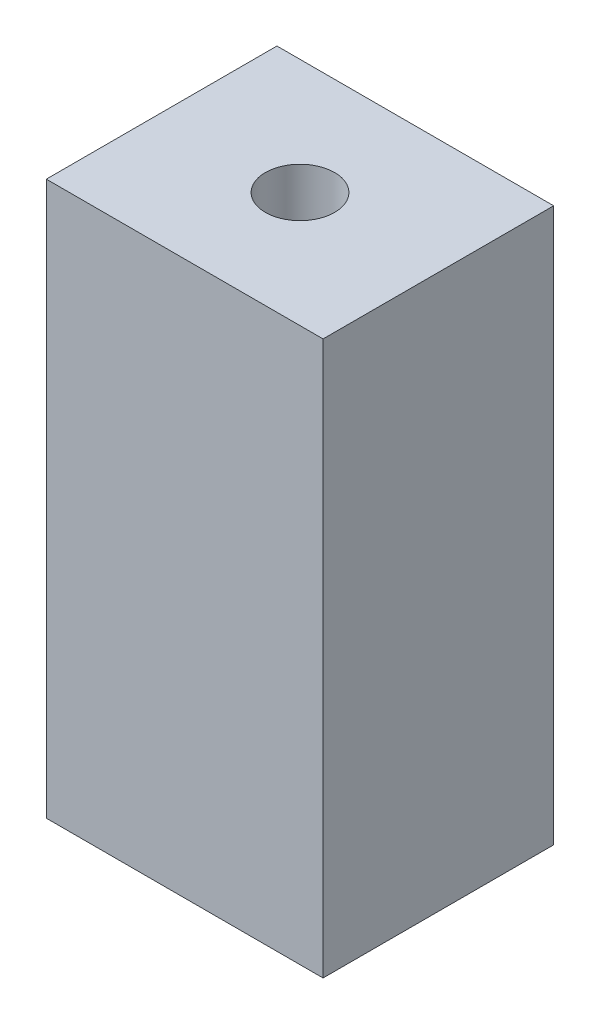
ISO-10303-21;
HEADER;
FILE_DESCRIPTION(('STEP AP214'),'2;1');
FILE_NAME('part.step','',(''),(''),'','','');
FILE_SCHEMA(('AUTOMOTIVE_DESIGN { 1 0 10303 214 1 1 1 1 }'));
ENDSEC;
DATA;
#1=APPLICATION_CONTEXT('core data for automotive mechanical design processes');
#2=APPLICATION_PROTOCOL_DEFINITION('international standard','automotive_design',2000,#1);
#3=PRODUCT_CONTEXT('',#1,'mechanical');
#4=PRODUCT('Part','Part','',(#3));
#5=PRODUCT_RELATED_PRODUCT_CATEGORY('part','',(#4));
#6=PRODUCT_DEFINITION_FORMATION('','',#4);
#7=PRODUCT_DEFINITION_CONTEXT('part definition',#1,'design');
#8=PRODUCT_DEFINITION('design','',#6,#7);
#9=PRODUCT_DEFINITION_SHAPE('','',#8);
#10=(LENGTH_UNIT() NAMED_UNIT(*) SI_UNIT(.MILLI.,.METRE.));
#11=(NAMED_UNIT(*) PLANE_ANGLE_UNIT() SI_UNIT($,.RADIAN.));
#12=(NAMED_UNIT(*) SI_UNIT($,.STERADIAN.) SOLID_ANGLE_UNIT());
#13=UNCERTAINTY_MEASURE_WITH_UNIT(LENGTH_MEASURE(1.E-05),#10,'distance_accuracy_value','');
#14=(GEOMETRIC_REPRESENTATION_CONTEXT(3) GLOBAL_UNCERTAINTY_ASSIGNED_CONTEXT((#13)) GLOBAL_UNIT_ASSIGNED_CONTEXT((#10,
#11,#12)) REPRESENTATION_CONTEXT('',''));
#15=CARTESIAN_POINT('',(0.,0.,0.));
#16=DIRECTION('',(0.,0.,1.));
#17=DIRECTION('',(1.,0.,0.));
#18=AXIS2_PLACEMENT_3D('',#15,#16,#17);
#19=CARTESIAN_POINT('',(0.,0.,0.));
#20=DIRECTION('',(0.,-1.,0.));
#21=DIRECTION('',(0.,0.,-1.));
#22=AXIS2_PLACEMENT_3D('',#19,#20,#21);
#23=PLANE('',#22);
#24=CARTESIAN_POINT('',(-4.5,0.,0.));
#25=DIRECTION('',(0.,-1.,0.));
#26=DIRECTION('',(0.,0.,-1.));
#27=AXIS2_PLACEMENT_3D('',#24,#25,#26);
#28=CIRCLE('',#27,0.624999999999999);
#29=CARTESIAN_POINT('',(-4.5,0.,-0.624999999999999));
#30=VERTEX_POINT('',#29);
#31=EDGE_CURVE('E99',#30,#30,#28,.T.);
#32=ORIENTED_EDGE('',*,*,#31,.F.);
#33=EDGE_LOOP('',(#32));
#34=FACE_BOUND('',#33,.T.);
#35=CARTESIAN_POINT('',(4.5,0.,0.));
#36=DIRECTION('',(0.,-1.,0.));
#37=DIRECTION('',(0.,0.,-1.));
#38=AXIS2_PLACEMENT_3D('',#35,#36,#37);
#39=CIRCLE('',#38,0.625);
#40=CARTESIAN_POINT('',(4.5,0.,-0.624999999999998));
#41=VERTEX_POINT('',#40);
#42=EDGE_CURVE('E98',#41,#41,#39,.T.);
#43=ORIENTED_EDGE('',*,*,#42,.F.);
#44=EDGE_LOOP('',(#43));
#45=FACE_BOUND('',#44,.T.);
#46=DIRECTION('',(0.,0.,-1.));
#47=VECTOR('',#46,1.);
#48=CARTESIAN_POINT('',(6.,0.,5.));
#49=LINE('',#48,#47);
#50=CARTESIAN_POINT('',(6.,0.,5.));
#51=VERTEX_POINT('',#50);
#52=CARTESIAN_POINT('',(6.,0.,-5.));
#53=VERTEX_POINT('',#52);
#54=EDGE_CURVE('E121',#51,#53,#49,.T.);
#55=ORIENTED_EDGE('',*,*,#54,.F.);
#56=DIRECTION('',(1.,0.,0.));
#57=VECTOR('',#56,1.);
#58=CARTESIAN_POINT('',(-6.,0.,5.));
#59=LINE('',#58,#57);
#60=CARTESIAN_POINT('',(-6.,0.,5.));
#61=VERTEX_POINT('',#60);
#62=EDGE_CURVE('E74',#61,#51,#59,.T.);
#63=ORIENTED_EDGE('',*,*,#62,.F.);
#64=DIRECTION('',(0.,0.,1.));
#65=VECTOR('',#64,1.);
#66=CARTESIAN_POINT('',(-6.,0.,5.));
#67=LINE('',#66,#65);
#68=CARTESIAN_POINT('',(-6.,0.,-5.));
#69=VERTEX_POINT('',#68);
#70=EDGE_CURVE('E68',#69,#61,#67,.T.);
#71=ORIENTED_EDGE('',*,*,#70,.F.);
#72=DIRECTION('',(-1.,0.,0.));
#73=VECTOR('',#72,1.);
#74=CARTESIAN_POINT('',(-6.,0.,-5.));
#75=LINE('',#74,#73);
#76=EDGE_CURVE('E131',#53,#69,#75,.T.);
#77=ORIENTED_EDGE('',*,*,#76,.F.);
#78=EDGE_LOOP('',(#55,#63,#71,#77));
#79=FACE_BOUND('',#78,.T.);
#80=CARTESIAN_POINT('',(0.,0.,0.));
#81=DIRECTION('',(0.,-1.,0.));
#82=DIRECTION('',(0.,0.,-1.));
#83=AXIS2_PLACEMENT_3D('',#80,#81,#82);
#84=CIRCLE('',#83,1.754);
#85=CARTESIAN_POINT('',(0.,0.,-1.754));
#86=VERTEX_POINT('',#85);
#87=EDGE_CURVE('E112',#86,#86,#84,.T.);
#88=ORIENTED_EDGE('',*,*,#87,.F.);
#89=EDGE_LOOP('',(#88));
#90=FACE_BOUND('',#89,.T.);
#91=ADVANCED_FACE('F33',(#34,#45,#79,#90),#23,.T.);
#92=CARTESIAN_POINT('',(0.,24.,0.));
#93=DIRECTION('',(0.,-1.,0.));
#94=DIRECTION('',(0.,0.,-1.));
#95=AXIS2_PLACEMENT_3D('',#92,#93,#94);
#96=PLANE('',#95);
#97=DIRECTION('',(0.,0.,-1.));
#98=VECTOR('',#97,1.);
#99=CARTESIAN_POINT('',(6.,24.,5.));
#100=LINE('',#99,#98);
#101=CARTESIAN_POINT('',(6.,24.,5.));
#102=VERTEX_POINT('',#101);
#103=CARTESIAN_POINT('',(6.,24.,-5.));
#104=VERTEX_POINT('',#103);
#105=EDGE_CURVE('E122',#102,#104,#100,.T.);
#106=ORIENTED_EDGE('',*,*,#105,.T.);
#107=DIRECTION('',(-1.,0.,0.));
#108=VECTOR('',#107,1.);
#109=CARTESIAN_POINT('',(-6.,24.,-5.));
#110=LINE('',#109,#108);
#111=CARTESIAN_POINT('',(-6.,24.,-5.));
#112=VERTEX_POINT('',#111);
#113=EDGE_CURVE('E81',#104,#112,#110,.T.);
#114=ORIENTED_EDGE('',*,*,#113,.T.);
#115=DIRECTION('',(0.,0.,1.));
#116=VECTOR('',#115,1.);
#117=CARTESIAN_POINT('',(-6.,24.,5.));
#118=LINE('',#117,#116);
#119=CARTESIAN_POINT('',(-6.,24.,5.));
#120=VERTEX_POINT('',#119);
#121=EDGE_CURVE('E125',#112,#120,#118,.T.);
#122=ORIENTED_EDGE('',*,*,#121,.T.);
#123=DIRECTION('',(1.,0.,0.));
#124=VECTOR('',#123,1.);
#125=CARTESIAN_POINT('',(-6.,24.,5.));
#126=LINE('',#125,#124);
#127=EDGE_CURVE('E50',#120,#102,#126,.T.);
#128=ORIENTED_EDGE('',*,*,#127,.T.);
#129=EDGE_LOOP('',(#106,#114,#122,#128));
#130=FACE_BOUND('',#129,.T.);
#131=CARTESIAN_POINT('',(0.,24.,0.));
#132=DIRECTION('',(0.,1.,0.));
#133=DIRECTION('',(0.,0.,1.));
#134=AXIS2_PLACEMENT_3D('',#131,#132,#133);
#135=CIRCLE('',#134,1.5);
#136=CARTESIAN_POINT('',(0.,24.,1.5));
#137=VERTEX_POINT('',#136);
#138=EDGE_CURVE('E116',#137,#137,#135,.T.);
#139=ORIENTED_EDGE('',*,*,#138,.F.);
#140=EDGE_LOOP('',(#139));
#141=FACE_BOUND('',#140,.T.);
#142=ADVANCED_FACE('F160',(#130,#141),#96,.F.);
#143=CARTESIAN_POINT('',(6.,24.,5.));
#144=DIRECTION('',(-1.,0.,0.));
#145=DIRECTION('',(0.,0.,1.));
#146=AXIS2_PLACEMENT_3D('',#143,#144,#145);
#147=PLANE('',#146);
#148=ORIENTED_EDGE('',*,*,#54,.T.);
#149=DIRECTION('',(0.,-1.,0.));
#150=VECTOR('',#149,1.);
#151=CARTESIAN_POINT('',(6.,24.,-5.));
#152=LINE('',#151,#150);
#153=EDGE_CURVE('E11',#104,#53,#152,.T.);
#154=ORIENTED_EDGE('',*,*,#153,.F.);
#155=ORIENTED_EDGE('',*,*,#105,.F.);
#156=DIRECTION('',(0.,-1.,0.));
#157=VECTOR('',#156,1.);
#158=CARTESIAN_POINT('',(6.,24.,5.));
#159=LINE('',#158,#157);
#160=EDGE_CURVE('E128',#102,#51,#159,.T.);
#161=ORIENTED_EDGE('',*,*,#160,.T.);
#162=EDGE_LOOP('',(#148,#154,#155,#161));
#163=FACE_BOUND('',#162,.T.);
#164=ADVANCED_FACE('F35',(#163),#147,.F.);
#165=CARTESIAN_POINT('',(-6.,24.,-5.));
#166=DIRECTION('',(0.,0.,1.));
#167=DIRECTION('',(1.,0.,0.));
#168=AXIS2_PLACEMENT_3D('',#165,#166,#167);
#169=PLANE('',#168);
#170=ORIENTED_EDGE('',*,*,#76,.T.);
#171=DIRECTION('',(0.,-1.,0.));
#172=VECTOR('',#171,1.);
#173=CARTESIAN_POINT('',(-6.,24.,-5.));
#174=LINE('',#173,#172);
#175=EDGE_CURVE('E42',#112,#69,#174,.T.);
#176=ORIENTED_EDGE('',*,*,#175,.F.);
#177=ORIENTED_EDGE('',*,*,#113,.F.);
#178=ORIENTED_EDGE('',*,*,#153,.T.);
#179=EDGE_LOOP('',(#170,#176,#177,#178));
#180=FACE_BOUND('',#179,.T.);
#181=ADVANCED_FACE('F156',(#180),#169,.F.);
#182=CARTESIAN_POINT('',(-6.,24.,5.));
#183=DIRECTION('',(1.,0.,0.));
#184=DIRECTION('',(0.,0.,-1.));
#185=AXIS2_PLACEMENT_3D('',#182,#183,#184);
#186=PLANE('',#185);
#187=ORIENTED_EDGE('',*,*,#70,.T.);
#188=DIRECTION('',(0.,-1.,0.));
#189=VECTOR('',#188,1.);
#190=CARTESIAN_POINT('',(-6.,24.,5.));
#191=LINE('',#190,#189);
#192=EDGE_CURVE('E136',#120,#61,#191,.T.);
#193=ORIENTED_EDGE('',*,*,#192,.F.);
#194=ORIENTED_EDGE('',*,*,#121,.F.);
#195=ORIENTED_EDGE('',*,*,#175,.T.);
#196=EDGE_LOOP('',(#187,#193,#194,#195));
#197=FACE_BOUND('',#196,.T.);
#198=ADVANCED_FACE('F138',(#197),#186,.F.);
#199=CARTESIAN_POINT('',(-6.,24.,5.));
#200=DIRECTION('',(0.,0.,-1.));
#201=DIRECTION('',(-1.,0.,0.));
#202=AXIS2_PLACEMENT_3D('',#199,#200,#201);
#203=PLANE('',#202);
#204=ORIENTED_EDGE('',*,*,#62,.T.);
#205=ORIENTED_EDGE('',*,*,#160,.F.);
#206=ORIENTED_EDGE('',*,*,#127,.F.);
#207=ORIENTED_EDGE('',*,*,#192,.T.);
#208=EDGE_LOOP('',(#204,#205,#206,#207));
#209=FACE_BOUND('',#208,.T.);
#210=ADVANCED_FACE('F145',(#209),#203,.F.);
#211=CARTESIAN_POINT('',(0.,24.,0.));
#212=DIRECTION('',(0.,-1.,0.));
#213=DIRECTION('',(0.,0.,-1.));
#214=AXIS2_PLACEMENT_3D('',#211,#212,#213);
#215=CYLINDRICAL_SURFACE('',#214,1.5);
#216=ORIENTED_EDGE('',*,*,#138,.T.);
#217=EDGE_LOOP('',(#216));
#218=FACE_BOUND('',#217,.T.);
#219=CARTESIAN_POINT('',(0.,-0.5,0.));
#220=DIRECTION('',(0.,-1.,0.));
#221=DIRECTION('',(0.,0.,-1.));
#222=AXIS2_PLACEMENT_3D('',#219,#220,#221);
#223=CIRCLE('',#222,1.5);
#224=CARTESIAN_POINT('',(0.,-0.5,-1.5));
#225=VERTEX_POINT('',#224);
#226=EDGE_CURVE('E109',#225,#225,#223,.T.);
#227=ORIENTED_EDGE('',*,*,#226,.T.);
#228=EDGE_LOOP('',(#227));
#229=FACE_BOUND('',#228,.T.);
#230=ADVANCED_FACE('F147',(#218,#229),#215,.F.);
#231=CARTESIAN_POINT('',(0.,-0.5,0.));
#232=DIRECTION('',(0.,-1.,0.));
#233=DIRECTION('',(0.,0.,-1.));
#234=AXIS2_PLACEMENT_3D('',#231,#232,#233);
#235=PLANE('',#234);
#236=CARTESIAN_POINT('',(0.,-0.5,0.));
#237=DIRECTION('',(0.,-1.,0.));
#238=DIRECTION('',(0.,0.,-1.));
#239=AXIS2_PLACEMENT_3D('',#236,#237,#238);
#240=CIRCLE('',#239,1.754);
#241=CARTESIAN_POINT('',(0.,-0.5,-1.754));
#242=VERTEX_POINT('',#241);
#243=EDGE_CURVE('E113',#242,#242,#240,.T.);
#244=ORIENTED_EDGE('',*,*,#243,.T.);
#245=EDGE_LOOP('',(#244));
#246=FACE_BOUND('',#245,.T.);
#247=ORIENTED_EDGE('',*,*,#226,.F.);
#248=EDGE_LOOP('',(#247));
#249=FACE_BOUND('',#248,.T.);
#250=ADVANCED_FACE('F153',(#246,#249),#235,.T.);
#251=CARTESIAN_POINT('',(0.,-0.5,0.));
#252=DIRECTION('',(0.,1.,0.));
#253=DIRECTION('',(0.,0.,1.));
#254=AXIS2_PLACEMENT_3D('',#251,#252,#253);
#255=CYLINDRICAL_SURFACE('',#254,1.754);
#256=ORIENTED_EDGE('',*,*,#243,.F.);
#257=EDGE_LOOP('',(#256));
#258=FACE_BOUND('',#257,.T.);
#259=ORIENTED_EDGE('',*,*,#87,.T.);
#260=EDGE_LOOP('',(#259));
#261=FACE_BOUND('',#260,.T.);
#262=ADVANCED_FACE('F169',(#258,#261),#255,.T.);
#263=CARTESIAN_POINT('',(4.5,0.624460113107775,0.));
#264=DIRECTION('',(0.,-1.,0.));
#265=DIRECTION('',(0.,0.,-1.));
#266=AXIS2_PLACEMENT_3D('',#263,#264,#265);
#267=CONICAL_SURFACE('',#266,0.624999999999999,1.02974425867665);
#268=CARTESIAN_POINT('',(4.5,0.999998,0.));
#269=VERTEX_POINT('',#268);
#270=VERTEX_LOOP('',#269);
#271=FACE_BOUND('',#270,.T.);
#272=CARTESIAN_POINT('',(4.5,0.624460113107775,0.));
#273=DIRECTION('',(0.,-1.,0.));
#274=DIRECTION('',(0.,0.,-1.));
#275=AXIS2_PLACEMENT_3D('',#272,#273,#274);
#276=CIRCLE('',#275,0.624999999999999);
#277=CARTESIAN_POINT('',(4.5,0.624460113107775,-0.624999999999998));
#278=VERTEX_POINT('',#277);
#279=EDGE_CURVE('E102',#278,#278,#276,.T.);
#280=ORIENTED_EDGE('',*,*,#279,.T.);
#281=EDGE_LOOP('',(#280));
#282=FACE_BOUND('',#281,.T.);
#283=ADVANCED_FACE('F172',(#271,#282),#267,.F.);
#284=CARTESIAN_POINT('',(4.5,0.,0.));
#285=DIRECTION('',(0.,-1.,0.));
#286=DIRECTION('',(0.,0.,-1.));
#287=AXIS2_PLACEMENT_3D('',#284,#285,#286);
#288=CYLINDRICAL_SURFACE('',#287,0.624999999999999);
#289=ORIENTED_EDGE('',*,*,#279,.F.);
#290=EDGE_LOOP('',(#289));
#291=FACE_BOUND('',#290,.T.);
#292=ORIENTED_EDGE('',*,*,#42,.T.);
#293=EDGE_LOOP('',(#292));
#294=FACE_BOUND('',#293,.T.);
#295=ADVANCED_FACE('F92',(#291,#294),#288,.F.);
#296=CARTESIAN_POINT('',(-4.5,0.624460113107775,0.));
#297=DIRECTION('',(0.,-1.,0.));
#298=DIRECTION('',(0.,0.,-1.));
#299=AXIS2_PLACEMENT_3D('',#296,#297,#298);
#300=CONICAL_SURFACE('',#299,0.624999999999999,1.02974425867665);
#301=CARTESIAN_POINT('',(-4.5,0.999998,0.));
#302=VERTEX_POINT('',#301);
#303=VERTEX_LOOP('',#302);
#304=FACE_BOUND('',#303,.T.);
#305=CARTESIAN_POINT('',(-4.5,0.624460113107775,0.));
#306=DIRECTION('',(0.,-1.,0.));
#307=DIRECTION('',(0.,0.,-1.));
#308=AXIS2_PLACEMENT_3D('',#305,#306,#307);
#309=CIRCLE('',#308,0.624999999999999);
#310=CARTESIAN_POINT('',(-4.5,0.624460113107775,-0.624999999999999));
#311=VERTEX_POINT('',#310);
#312=EDGE_CURVE('E96',#311,#311,#309,.T.);
#313=ORIENTED_EDGE('',*,*,#312,.T.);
#314=EDGE_LOOP('',(#313));
#315=FACE_BOUND('',#314,.T.);
#316=ADVANCED_FACE('F88',(#304,#315),#300,.F.);
#317=CARTESIAN_POINT('',(-4.5,0.,0.));
#318=DIRECTION('',(0.,-1.,0.));
#319=DIRECTION('',(0.,0.,-1.));
#320=AXIS2_PLACEMENT_3D('',#317,#318,#319);
#321=CYLINDRICAL_SURFACE('',#320,0.624999999999999);
#322=ORIENTED_EDGE('',*,*,#312,.F.);
#323=EDGE_LOOP('',(#322));
#324=FACE_BOUND('',#323,.T.);
#325=ORIENTED_EDGE('',*,*,#31,.T.);
#326=EDGE_LOOP('',(#325));
#327=FACE_BOUND('',#326,.T.);
#328=ADVANCED_FACE('F91',(#324,#327),#321,.F.);
#329=CLOSED_SHELL('',(#91,#142,#164,#181,#198,#210,#230,#250,#262,#283,#295,#316,#328));
#330=MANIFOLD_SOLID_BREP('B2',#329);
#331=ADVANCED_BREP_SHAPE_REPRESENTATION('',(#18,#330),#14);
#332=SHAPE_DEFINITION_REPRESENTATION(#9,#331);
ENDSEC;
END-ISO-10303-21;
